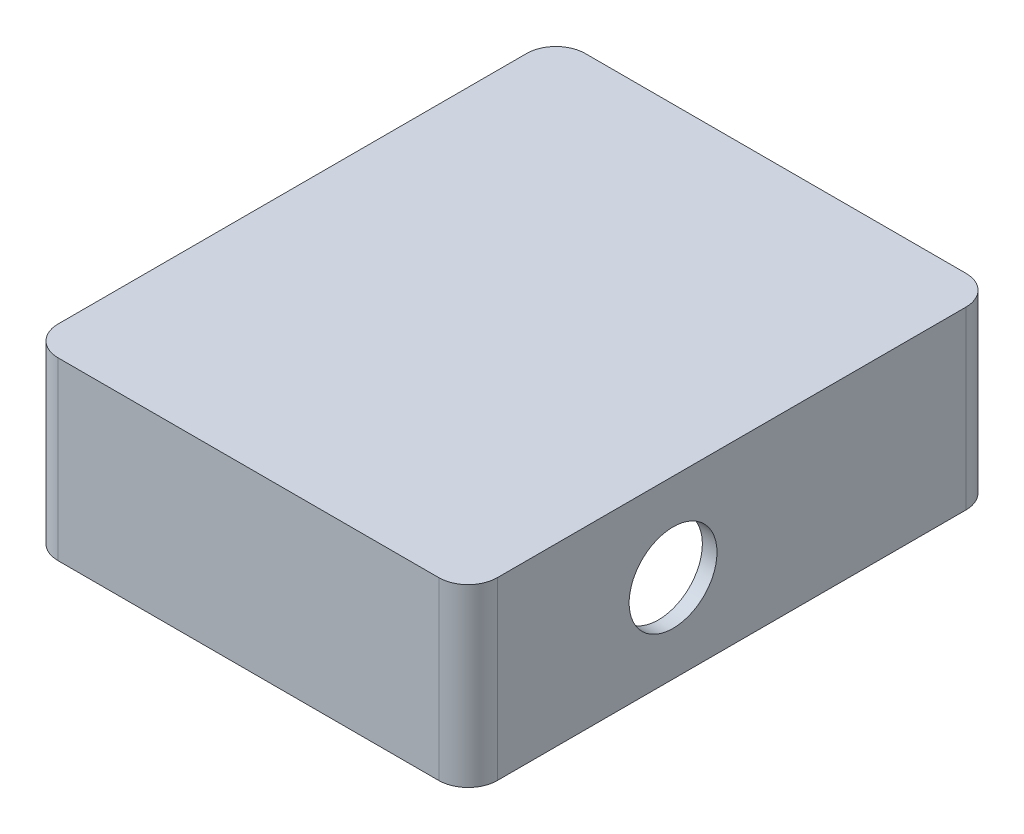
ISO-10303-21;
HEADER;
FILE_DESCRIPTION(('STEP AP214'),'2;1');
FILE_NAME('part.step','',(''),(''),'','','');
FILE_SCHEMA(('AUTOMOTIVE_DESIGN { 1 0 10303 214 1 1 1 1 }'));
ENDSEC;
DATA;
#1=APPLICATION_CONTEXT('core data for automotive mechanical design processes');
#2=APPLICATION_PROTOCOL_DEFINITION('international standard','automotive_design',2000,#1);
#3=PRODUCT_CONTEXT('',#1,'mechanical');
#4=PRODUCT('Part','Part','',(#3));
#5=PRODUCT_RELATED_PRODUCT_CATEGORY('part','',(#4));
#6=PRODUCT_DEFINITION_FORMATION('','',#4);
#7=PRODUCT_DEFINITION_CONTEXT('part definition',#1,'design');
#8=PRODUCT_DEFINITION('design','',#6,#7);
#9=PRODUCT_DEFINITION_SHAPE('','',#8);
#10=(LENGTH_UNIT() NAMED_UNIT(*) SI_UNIT(.MILLI.,.METRE.));
#11=(NAMED_UNIT(*) PLANE_ANGLE_UNIT() SI_UNIT($,.RADIAN.));
#12=(NAMED_UNIT(*) SI_UNIT($,.STERADIAN.) SOLID_ANGLE_UNIT());
#13=UNCERTAINTY_MEASURE_WITH_UNIT(LENGTH_MEASURE(1.E-05),#10,'distance_accuracy_value','');
#14=(GEOMETRIC_REPRESENTATION_CONTEXT(3) GLOBAL_UNCERTAINTY_ASSIGNED_CONTEXT((#13)) GLOBAL_UNIT_ASSIGNED_CONTEXT((#10,
#11,#12)) REPRESENTATION_CONTEXT('',''));
#15=CARTESIAN_POINT('',(0.,0.,0.));
#16=DIRECTION('',(0.,0.,1.));
#17=DIRECTION('',(1.,0.,0.));
#18=AXIS2_PLACEMENT_3D('',#15,#16,#17);
#19=CARTESIAN_POINT('',(5.,30.,-5.));
#20=DIRECTION('',(0.,-1.,0.));
#21=DIRECTION('',(0.,0.,-1.));
#22=AXIS2_PLACEMENT_3D('',#19,#20,#21);
#23=CYLINDRICAL_SURFACE('',#22,5.);
#24=CARTESIAN_POINT('',(5.,0.,-5.));
#25=DIRECTION('',(0.,-1.,0.));
#26=DIRECTION('',(0.,0.,-1.));
#27=AXIS2_PLACEMENT_3D('',#24,#25,#26);
#28=CIRCLE('',#27,5.);
#29=CARTESIAN_POINT('',(5.00000000000004,0.,0.));
#30=VERTEX_POINT('',#29);
#31=CARTESIAN_POINT('',(0.,0.,-5.00000000000003));
#32=VERTEX_POINT('',#31);
#33=EDGE_CURVE('E156',#30,#32,#28,.T.);
#34=ORIENTED_EDGE('',*,*,#33,.F.);
#35=DIRECTION('',(0.,-1.,0.));
#36=VECTOR('',#35,1.);
#37=CARTESIAN_POINT('',(5.00000000000004,30.,0.));
#38=LINE('',#37,#36);
#39=CARTESIAN_POINT('',(5.00000000000004,30.,0.));
#40=VERTEX_POINT('',#39);
#41=EDGE_CURVE('E11',#40,#30,#38,.T.);
#42=ORIENTED_EDGE('',*,*,#41,.F.);
#43=CARTESIAN_POINT('',(5.,30.,-5.));
#44=DIRECTION('',(0.,-1.,0.));
#45=DIRECTION('',(0.,0.,-1.));
#46=AXIS2_PLACEMENT_3D('',#43,#44,#45);
#47=CIRCLE('',#46,5.);
#48=CARTESIAN_POINT('',(0.,30.,-5.00000000000003));
#49=VERTEX_POINT('',#48);
#50=EDGE_CURVE('E184',#40,#49,#47,.T.);
#51=ORIENTED_EDGE('',*,*,#50,.T.);
#52=DIRECTION('',(0.,-1.,0.));
#53=VECTOR('',#52,1.);
#54=CARTESIAN_POINT('',(0.,30.,-5.00000000000003));
#55=LINE('',#54,#53);
#56=EDGE_CURVE('E100',#49,#32,#55,.T.);
#57=ORIENTED_EDGE('',*,*,#56,.T.);
#58=EDGE_LOOP('',(#34,#42,#51,#57));
#59=FACE_BOUND('',#58,.T.);
#60=ADVANCED_FACE('F38',(#59),#23,.T.);
#61=CARTESIAN_POINT('',(5.00000000000004,30.,0.));
#62=DIRECTION('',(0.,0.,-1.));
#63=DIRECTION('',(-1.,0.,0.));
#64=AXIS2_PLACEMENT_3D('',#61,#62,#63);
#65=PLANE('',#64);
#66=DIRECTION('',(1.,0.,0.));
#67=VECTOR('',#66,1.);
#68=CARTESIAN_POINT('',(5.00000000000004,0.,0.));
#69=LINE('',#68,#67);
#70=CARTESIAN_POINT('',(70.,0.,0.));
#71=VERTEX_POINT('',#70);
#72=EDGE_CURVE('E182',#30,#71,#69,.T.);
#73=ORIENTED_EDGE('',*,*,#72,.T.);
#74=DIRECTION('',(0.,-1.,0.));
#75=VECTOR('',#74,1.);
#76=CARTESIAN_POINT('',(70.,30.,0.));
#77=LINE('',#76,#75);
#78=CARTESIAN_POINT('',(70.,30.,0.));
#79=VERTEX_POINT('',#78);
#80=EDGE_CURVE('E47',#79,#71,#77,.T.);
#81=ORIENTED_EDGE('',*,*,#80,.F.);
#82=DIRECTION('',(1.,0.,0.));
#83=VECTOR('',#82,1.);
#84=CARTESIAN_POINT('',(5.00000000000004,30.,0.));
#85=LINE('',#84,#83);
#86=EDGE_CURVE('E127',#40,#79,#85,.T.);
#87=ORIENTED_EDGE('',*,*,#86,.F.);
#88=ORIENTED_EDGE('',*,*,#41,.T.);
#89=EDGE_LOOP('',(#73,#81,#87,#88));
#90=FACE_BOUND('',#89,.T.);
#91=ADVANCED_FACE('F203',(#90),#65,.F.);
#92=CARTESIAN_POINT('',(70.,30.,-5.));
#93=DIRECTION('',(0.,-1.,0.));
#94=DIRECTION('',(0.,0.,-1.));
#95=AXIS2_PLACEMENT_3D('',#92,#93,#94);
#96=CYLINDRICAL_SURFACE('',#95,5.);
#97=CARTESIAN_POINT('',(70.,0.,-5.));
#98=DIRECTION('',(0.,1.,0.));
#99=DIRECTION('',(0.,0.,1.));
#100=AXIS2_PLACEMENT_3D('',#97,#98,#99);
#101=CIRCLE('',#100,5.);
#102=CARTESIAN_POINT('',(75.,0.,-5.));
#103=VERTEX_POINT('',#102);
#104=EDGE_CURVE('E137',#71,#103,#101,.T.);
#105=ORIENTED_EDGE('',*,*,#104,.T.);
#106=DIRECTION('',(0.,-1.,0.));
#107=VECTOR('',#106,1.);
#108=CARTESIAN_POINT('',(75.,30.,-5.));
#109=LINE('',#108,#107);
#110=CARTESIAN_POINT('',(75.,30.,-5.));
#111=VERTEX_POINT('',#110);
#112=EDGE_CURVE('E134',#111,#103,#109,.T.);
#113=ORIENTED_EDGE('',*,*,#112,.F.);
#114=CARTESIAN_POINT('',(70.,30.,-5.));
#115=DIRECTION('',(0.,1.,0.));
#116=DIRECTION('',(0.,0.,1.));
#117=AXIS2_PLACEMENT_3D('',#114,#115,#116);
#118=CIRCLE('',#117,5.);
#119=EDGE_CURVE('E119',#79,#111,#118,.T.);
#120=ORIENTED_EDGE('',*,*,#119,.F.);
#121=ORIENTED_EDGE('',*,*,#80,.T.);
#122=EDGE_LOOP('',(#105,#113,#120,#121));
#123=FACE_BOUND('',#122,.T.);
#124=ADVANCED_FACE('F135',(#123),#96,.T.);
#125=CARTESIAN_POINT('',(75.,30.,-5.));
#126=DIRECTION('',(-1.,0.,0.));
#127=DIRECTION('',(0.,0.,1.));
#128=AXIS2_PLACEMENT_3D('',#125,#126,#127);
#129=PLANE('',#128);
#130=CARTESIAN_POINT('',(75.,15.,-35.));
#131=DIRECTION('',(1.,0.,0.));
#132=DIRECTION('',(0.,0.,-1.));
#133=AXIS2_PLACEMENT_3D('',#130,#131,#132);
#134=CIRCLE('',#133,7.50000000000001);
#135=CARTESIAN_POINT('',(75.,15.,-42.5));
#136=VERTEX_POINT('',#135);
#137=EDGE_CURVE('E296',#136,#136,#134,.T.);
#138=ORIENTED_EDGE('',*,*,#137,.F.);
#139=EDGE_LOOP('',(#138));
#140=FACE_BOUND('',#139,.T.);
#141=DIRECTION('',(0.,0.,-1.));
#142=VECTOR('',#141,1.);
#143=CARTESIAN_POINT('',(75.,0.,-5.));
#144=LINE('',#143,#142);
#145=CARTESIAN_POINT('',(75.,0.,-85.));
#146=VERTEX_POINT('',#145);
#147=EDGE_CURVE('E177',#103,#146,#144,.T.);
#148=ORIENTED_EDGE('',*,*,#147,.T.);
#149=DIRECTION('',(0.,-1.,0.));
#150=VECTOR('',#149,1.);
#151=CARTESIAN_POINT('',(75.,30.,-85.));
#152=LINE('',#151,#150);
#153=CARTESIAN_POINT('',(75.,30.,-85.));
#154=VERTEX_POINT('',#153);
#155=EDGE_CURVE('E142',#154,#146,#152,.T.);
#156=ORIENTED_EDGE('',*,*,#155,.F.);
#157=DIRECTION('',(0.,0.,-1.));
#158=VECTOR('',#157,1.);
#159=CARTESIAN_POINT('',(75.,30.,-5.));
#160=LINE('',#159,#158);
#161=EDGE_CURVE('E125',#111,#154,#160,.T.);
#162=ORIENTED_EDGE('',*,*,#161,.F.);
#163=ORIENTED_EDGE('',*,*,#112,.T.);
#164=EDGE_LOOP('',(#148,#156,#162,#163));
#165=FACE_BOUND('',#164,.T.);
#166=ADVANCED_FACE('F144',(#140,#165),#129,.F.);
#167=CARTESIAN_POINT('',(70.,30.,-85.));
#168=DIRECTION('',(0.,-1.,0.));
#169=DIRECTION('',(0.,0.,-1.));
#170=AXIS2_PLACEMENT_3D('',#167,#168,#169);
#171=CYLINDRICAL_SURFACE('',#170,5.);
#172=CARTESIAN_POINT('',(70.,0.,-85.));
#173=DIRECTION('',(0.,-1.,0.));
#174=DIRECTION('',(0.,0.,-1.));
#175=AXIS2_PLACEMENT_3D('',#172,#173,#174);
#176=CIRCLE('',#175,5.);
#177=CARTESIAN_POINT('',(70.,0.,-90.));
#178=VERTEX_POINT('',#177);
#179=EDGE_CURVE('E173',#178,#146,#176,.T.);
#180=ORIENTED_EDGE('',*,*,#179,.F.);
#181=DIRECTION('',(0.,-1.,0.));
#182=VECTOR('',#181,1.);
#183=CARTESIAN_POINT('',(70.,30.,-90.));
#184=LINE('',#183,#182);
#185=CARTESIAN_POINT('',(70.,30.,-90.));
#186=VERTEX_POINT('',#185);
#187=EDGE_CURVE('E190',#186,#178,#184,.T.);
#188=ORIENTED_EDGE('',*,*,#187,.F.);
#189=CARTESIAN_POINT('',(70.,30.,-85.));
#190=DIRECTION('',(0.,-1.,0.));
#191=DIRECTION('',(0.,0.,-1.));
#192=AXIS2_PLACEMENT_3D('',#189,#190,#191);
#193=CIRCLE('',#192,5.);
#194=EDGE_CURVE('E147',#186,#154,#193,.T.);
#195=ORIENTED_EDGE('',*,*,#194,.T.);
#196=ORIENTED_EDGE('',*,*,#155,.T.);
#197=EDGE_LOOP('',(#180,#188,#195,#196));
#198=FACE_BOUND('',#197,.T.);
#199=ADVANCED_FACE('F227',(#198),#171,.T.);
#200=CARTESIAN_POINT('',(5.00000000000004,30.,-90.));
#201=DIRECTION('',(0.,0.,-1.));
#202=DIRECTION('',(-1.,0.,0.));
#203=AXIS2_PLACEMENT_3D('',#200,#201,#202);
#204=PLANE('',#203);
#205=DIRECTION('',(1.,0.,0.));
#206=VECTOR('',#205,1.);
#207=CARTESIAN_POINT('',(5.00000000000004,0.,-90.));
#208=LINE('',#207,#206);
#209=CARTESIAN_POINT('',(5.,0.,-90.));
#210=VERTEX_POINT('',#209);
#211=EDGE_CURVE('E169',#210,#178,#208,.T.);
#212=ORIENTED_EDGE('',*,*,#211,.F.);
#213=DIRECTION('',(0.,-1.,0.));
#214=VECTOR('',#213,1.);
#215=CARTESIAN_POINT('',(5.,30.,-90.));
#216=LINE('',#215,#214);
#217=CARTESIAN_POINT('',(5.,30.,-90.));
#218=VERTEX_POINT('',#217);
#219=EDGE_CURVE('E193',#218,#210,#216,.T.);
#220=ORIENTED_EDGE('',*,*,#219,.F.);
#221=DIRECTION('',(1.,0.,0.));
#222=VECTOR('',#221,1.);
#223=CARTESIAN_POINT('',(5.00000000000004,30.,-90.));
#224=LINE('',#223,#222);
#225=EDGE_CURVE('E150',#218,#186,#224,.T.);
#226=ORIENTED_EDGE('',*,*,#225,.T.);
#227=ORIENTED_EDGE('',*,*,#187,.T.);
#228=EDGE_LOOP('',(#212,#220,#226,#227));
#229=FACE_BOUND('',#228,.T.);
#230=ADVANCED_FACE('F222',(#229),#204,.T.);
#231=CARTESIAN_POINT('',(5.,30.,-85.));
#232=DIRECTION('',(0.,-1.,0.));
#233=DIRECTION('',(0.,0.,-1.));
#234=AXIS2_PLACEMENT_3D('',#231,#232,#233);
#235=CYLINDRICAL_SURFACE('',#234,5.);
#236=CARTESIAN_POINT('',(5.,0.,-85.));
#237=DIRECTION('',(0.,-1.,0.));
#238=DIRECTION('',(0.,0.,-1.));
#239=AXIS2_PLACEMENT_3D('',#236,#237,#238);
#240=CIRCLE('',#239,5.);
#241=CARTESIAN_POINT('',(0.,0.,-85.));
#242=VERTEX_POINT('',#241);
#243=EDGE_CURVE('E165',#242,#210,#240,.T.);
#244=ORIENTED_EDGE('',*,*,#243,.F.);
#245=DIRECTION('',(0.,-1.,0.));
#246=VECTOR('',#245,1.);
#247=CARTESIAN_POINT('',(0.,30.,-85.));
#248=LINE('',#247,#246);
#249=CARTESIAN_POINT('',(0.,30.,-85.));
#250=VERTEX_POINT('',#249);
#251=EDGE_CURVE('E196',#250,#242,#248,.T.);
#252=ORIENTED_EDGE('',*,*,#251,.F.);
#253=CARTESIAN_POINT('',(5.,30.,-85.));
#254=DIRECTION('',(0.,-1.,0.));
#255=DIRECTION('',(0.,0.,-1.));
#256=AXIS2_PLACEMENT_3D('',#253,#254,#255);
#257=CIRCLE('',#256,5.);
#258=EDGE_CURVE('E209',#250,#218,#257,.T.);
#259=ORIENTED_EDGE('',*,*,#258,.T.);
#260=ORIENTED_EDGE('',*,*,#219,.T.);
#261=EDGE_LOOP('',(#244,#252,#259,#260));
#262=FACE_BOUND('',#261,.T.);
#263=ADVANCED_FACE('F225',(#262),#235,.T.);
#264=CARTESIAN_POINT('',(0.,30.,-5.00000000000003));
#265=DIRECTION('',(-1.,0.,0.));
#266=DIRECTION('',(0.,0.,1.));
#267=AXIS2_PLACEMENT_3D('',#264,#265,#266);
#268=PLANE('',#267);
#269=DIRECTION('',(0.,0.,-1.));
#270=VECTOR('',#269,1.);
#271=CARTESIAN_POINT('',(0.,0.,-5.00000000000003));
#272=LINE('',#271,#270);
#273=EDGE_CURVE('E160',#32,#242,#272,.T.);
#274=ORIENTED_EDGE('',*,*,#273,.F.);
#275=ORIENTED_EDGE('',*,*,#56,.F.);
#276=DIRECTION('',(0.,0.,-1.));
#277=VECTOR('',#276,1.);
#278=CARTESIAN_POINT('',(0.,30.,-5.00000000000003));
#279=LINE('',#278,#277);
#280=EDGE_CURVE('E205',#49,#250,#279,.T.);
#281=ORIENTED_EDGE('',*,*,#280,.T.);
#282=ORIENTED_EDGE('',*,*,#251,.T.);
#283=EDGE_LOOP('',(#274,#275,#281,#282));
#284=FACE_BOUND('',#283,.T.);
#285=ADVANCED_FACE('F199',(#284),#268,.T.);
#286=CARTESIAN_POINT('',(5.,30.,-5.));
#287=DIRECTION('',(0.,-1.,0.));
#288=DIRECTION('',(0.,0.,-1.));
#289=AXIS2_PLACEMENT_3D('',#286,#287,#288);
#290=PLANE('',#289);
#291=ORIENTED_EDGE('',*,*,#50,.F.);
#292=ORIENTED_EDGE('',*,*,#86,.T.);
#293=ORIENTED_EDGE('',*,*,#119,.T.);
#294=ORIENTED_EDGE('',*,*,#161,.T.);
#295=ORIENTED_EDGE('',*,*,#194,.F.);
#296=ORIENTED_EDGE('',*,*,#225,.F.);
#297=ORIENTED_EDGE('',*,*,#258,.F.);
#298=ORIENTED_EDGE('',*,*,#280,.F.);
#299=EDGE_LOOP('',(#291,#292,#293,#294,#295,#296,#297,#298));
#300=FACE_BOUND('',#299,.T.);
#301=ADVANCED_FACE('F122',(#300),#290,.F.);
#302=CARTESIAN_POINT('',(5.,0.,-5.));
#303=DIRECTION('',(0.,-1.,0.));
#304=DIRECTION('',(0.,0.,-1.));
#305=AXIS2_PLACEMENT_3D('',#302,#303,#304);
#306=PLANE('',#305);
#307=CARTESIAN_POINT('',(7.5,0.,-7.5));
#308=DIRECTION('',(0.,-1.,0.));
#309=DIRECTION('',(0.,0.,1.));
#310=AXIS2_PLACEMENT_3D('',#307,#308,#309);
#311=CIRCLE('',#310,5.);
#312=CARTESIAN_POINT('',(7.50000000000003,0.,-2.5));
#313=VERTEX_POINT('',#312);
#314=CARTESIAN_POINT('',(2.5,0.,-7.50000000000003));
#315=VERTEX_POINT('',#314);
#316=EDGE_CURVE('E55',#313,#315,#311,.T.);
#317=ORIENTED_EDGE('',*,*,#316,.F.);
#318=DIRECTION('',(-1.,0.,0.));
#319=VECTOR('',#318,1.);
#320=CARTESIAN_POINT('',(7.50000000000003,0.,-2.5));
#321=LINE('',#320,#319);
#322=CARTESIAN_POINT('',(67.5,0.,-2.49999999999999));
#323=VERTEX_POINT('',#322);
#324=EDGE_CURVE('E311',#323,#313,#321,.T.);
#325=ORIENTED_EDGE('',*,*,#324,.F.);
#326=CARTESIAN_POINT('',(67.5,0.,-7.49999999999999));
#327=DIRECTION('',(0.,-1.,0.));
#328=DIRECTION('',(0.,0.,1.));
#329=AXIS2_PLACEMENT_3D('',#326,#327,#328);
#330=CIRCLE('',#329,5.);
#331=CARTESIAN_POINT('',(72.5,0.,-7.49999999999999));
#332=VERTEX_POINT('',#331);
#333=EDGE_CURVE('E358',#332,#323,#330,.T.);
#334=ORIENTED_EDGE('',*,*,#333,.F.);
#335=DIRECTION('',(0.,0.,1.));
#336=VECTOR('',#335,1.);
#337=CARTESIAN_POINT('',(72.5,0.,-7.49999999999999));
#338=LINE('',#337,#336);
#339=CARTESIAN_POINT('',(72.5,0.,-82.5));
#340=VERTEX_POINT('',#339);
#341=EDGE_CURVE('E354',#340,#332,#338,.T.);
#342=ORIENTED_EDGE('',*,*,#341,.F.);
#343=CARTESIAN_POINT('',(67.5,0.,-82.5));
#344=DIRECTION('',(0.,-1.,0.));
#345=DIRECTION('',(0.,0.,-1.));
#346=AXIS2_PLACEMENT_3D('',#343,#344,#345);
#347=CIRCLE('',#346,5.);
#348=CARTESIAN_POINT('',(67.5,0.,-87.5));
#349=VERTEX_POINT('',#348);
#350=EDGE_CURVE('E350',#349,#340,#347,.T.);
#351=ORIENTED_EDGE('',*,*,#350,.F.);
#352=DIRECTION('',(1.,0.,0.));
#353=VECTOR('',#352,1.);
#354=CARTESIAN_POINT('',(7.50000000000004,0.,-87.5));
#355=LINE('',#354,#353);
#356=CARTESIAN_POINT('',(7.5,0.,-87.5));
#357=VERTEX_POINT('',#356);
#358=EDGE_CURVE('E346',#357,#349,#355,.T.);
#359=ORIENTED_EDGE('',*,*,#358,.F.);
#360=CARTESIAN_POINT('',(7.5,0.,-82.5));
#361=DIRECTION('',(0.,-1.,0.));
#362=DIRECTION('',(0.,0.,-1.));
#363=AXIS2_PLACEMENT_3D('',#360,#361,#362);
#364=CIRCLE('',#363,5.);
#365=CARTESIAN_POINT('',(2.5,0.,-82.5));
#366=VERTEX_POINT('',#365);
#367=EDGE_CURVE('E342',#366,#357,#364,.T.);
#368=ORIENTED_EDGE('',*,*,#367,.F.);
#369=DIRECTION('',(0.,0.,-1.));
#370=VECTOR('',#369,1.);
#371=CARTESIAN_POINT('',(2.5,0.,-7.50000000000003));
#372=LINE('',#371,#370);
#373=EDGE_CURVE('E302',#315,#366,#372,.T.);
#374=ORIENTED_EDGE('',*,*,#373,.F.);
#375=EDGE_LOOP('',(#317,#325,#334,#342,#351,#359,#368,#374));
#376=FACE_BOUND('',#375,.T.);
#377=ORIENTED_EDGE('',*,*,#33,.T.);
#378=ORIENTED_EDGE('',*,*,#273,.T.);
#379=ORIENTED_EDGE('',*,*,#243,.T.);
#380=ORIENTED_EDGE('',*,*,#211,.T.);
#381=ORIENTED_EDGE('',*,*,#179,.T.);
#382=ORIENTED_EDGE('',*,*,#147,.F.);
#383=ORIENTED_EDGE('',*,*,#104,.F.);
#384=ORIENTED_EDGE('',*,*,#72,.F.);
#385=EDGE_LOOP('',(#377,#378,#379,#380,#381,#382,#383,#384));
#386=FACE_BOUND('',#385,.T.);
#387=ADVANCED_FACE('F202',(#376,#386),#306,.T.);
#388=CARTESIAN_POINT('',(7.5,28.,-7.5));
#389=DIRECTION('',(0.,-1.,0.));
#390=DIRECTION('',(0.,0.,-1.));
#391=AXIS2_PLACEMENT_3D('',#388,#389,#390);
#392=CYLINDRICAL_SURFACE('',#391,5.);
#393=ORIENTED_EDGE('',*,*,#316,.T.);
#394=DIRECTION('',(0.,-1.,0.));
#395=VECTOR('',#394,1.);
#396=CARTESIAN_POINT('',(2.5,28.,-7.50000000000003));
#397=LINE('',#396,#395);
#398=CARTESIAN_POINT('',(2.5,28.,-7.50000000000003));
#399=VERTEX_POINT('',#398);
#400=EDGE_CURVE('E212',#399,#315,#397,.T.);
#401=ORIENTED_EDGE('',*,*,#400,.F.);
#402=CARTESIAN_POINT('',(7.5,28.,-7.5));
#403=DIRECTION('',(0.,-1.,0.));
#404=DIRECTION('',(0.,0.,1.));
#405=AXIS2_PLACEMENT_3D('',#402,#403,#404);
#406=CIRCLE('',#405,5.);
#407=CARTESIAN_POINT('',(7.50000000000003,28.,-2.5));
#408=VERTEX_POINT('',#407);
#409=EDGE_CURVE('E306',#408,#399,#406,.T.);
#410=ORIENTED_EDGE('',*,*,#409,.F.);
#411=DIRECTION('',(0.,-1.,0.));
#412=VECTOR('',#411,1.);
#413=CARTESIAN_POINT('',(7.50000000000003,28.,-2.5));
#414=LINE('',#413,#412);
#415=EDGE_CURVE('E161',#408,#313,#414,.T.);
#416=ORIENTED_EDGE('',*,*,#415,.T.);
#417=EDGE_LOOP('',(#393,#401,#410,#416));
#418=FACE_BOUND('',#417,.T.);
#419=ADVANCED_FACE('F250',(#418),#392,.F.);
#420=CARTESIAN_POINT('',(7.50000000000003,28.,-2.5));
#421=DIRECTION('',(0.,0.,1.));
#422=DIRECTION('',(1.,0.,0.));
#423=AXIS2_PLACEMENT_3D('',#420,#421,#422);
#424=PLANE('',#423);
#425=ORIENTED_EDGE('',*,*,#324,.T.);
#426=ORIENTED_EDGE('',*,*,#415,.F.);
#427=DIRECTION('',(-1.,0.,0.));
#428=VECTOR('',#427,1.);
#429=CARTESIAN_POINT('',(7.50000000000003,28.,-2.5));
#430=LINE('',#429,#428);
#431=CARTESIAN_POINT('',(67.5,28.,-2.49999999999999));
#432=VERTEX_POINT('',#431);
#433=EDGE_CURVE('E335',#432,#408,#430,.T.);
#434=ORIENTED_EDGE('',*,*,#433,.F.);
#435=DIRECTION('',(0.,-1.,0.));
#436=VECTOR('',#435,1.);
#437=CARTESIAN_POINT('',(67.5,28.,-2.49999999999999));
#438=LINE('',#437,#436);
#439=EDGE_CURVE('E367',#432,#323,#438,.T.);
#440=ORIENTED_EDGE('',*,*,#439,.T.);
#441=EDGE_LOOP('',(#425,#426,#434,#440));
#442=FACE_BOUND('',#441,.T.);
#443=ADVANCED_FACE('F256',(#442),#424,.F.);
#444=CARTESIAN_POINT('',(67.5,28.,-7.49999999999999));
#445=DIRECTION('',(0.,-1.,0.));
#446=DIRECTION('',(0.,0.,-1.));
#447=AXIS2_PLACEMENT_3D('',#444,#445,#446);
#448=CYLINDRICAL_SURFACE('',#447,5.);
#449=ORIENTED_EDGE('',*,*,#333,.T.);
#450=ORIENTED_EDGE('',*,*,#439,.F.);
#451=CARTESIAN_POINT('',(67.5,28.,-7.49999999999999));
#452=DIRECTION('',(0.,-1.,0.));
#453=DIRECTION('',(0.,0.,1.));
#454=AXIS2_PLACEMENT_3D('',#451,#452,#453);
#455=CIRCLE('',#454,5.);
#456=CARTESIAN_POINT('',(72.5,28.,-7.49999999999999));
#457=VERTEX_POINT('',#456);
#458=EDGE_CURVE('E331',#457,#432,#455,.T.);
#459=ORIENTED_EDGE('',*,*,#458,.F.);
#460=DIRECTION('',(0.,-1.,0.));
#461=VECTOR('',#460,1.);
#462=CARTESIAN_POINT('',(72.5,28.,-7.49999999999999));
#463=LINE('',#462,#461);
#464=EDGE_CURVE('E371',#457,#332,#463,.T.);
#465=ORIENTED_EDGE('',*,*,#464,.T.);
#466=EDGE_LOOP('',(#449,#450,#459,#465));
#467=FACE_BOUND('',#466,.T.);
#468=ADVANCED_FACE('F277',(#467),#448,.F.);
#469=CARTESIAN_POINT('',(72.5,28.,-7.49999999999999));
#470=DIRECTION('',(1.,0.,0.));
#471=DIRECTION('',(0.,0.,-1.));
#472=AXIS2_PLACEMENT_3D('',#469,#470,#471);
#473=PLANE('',#472);
#474=CARTESIAN_POINT('',(72.5,15.,-35.));
#475=DIRECTION('',(1.,0.,0.));
#476=DIRECTION('',(0.,0.,-1.));
#477=AXIS2_PLACEMENT_3D('',#474,#475,#476);
#478=CIRCLE('',#477,7.50000000000001);
#479=CARTESIAN_POINT('',(72.5,15.,-42.5));
#480=VERTEX_POINT('',#479);
#481=EDGE_CURVE('E41',#480,#480,#478,.T.);
#482=ORIENTED_EDGE('',*,*,#481,.T.);
#483=EDGE_LOOP('',(#482));
#484=FACE_BOUND('',#483,.T.);
#485=ORIENTED_EDGE('',*,*,#341,.T.);
#486=ORIENTED_EDGE('',*,*,#464,.F.);
#487=DIRECTION('',(0.,0.,1.));
#488=VECTOR('',#487,1.);
#489=CARTESIAN_POINT('',(72.5,28.,-7.49999999999999));
#490=LINE('',#489,#488);
#491=CARTESIAN_POINT('',(72.5,28.,-82.5));
#492=VERTEX_POINT('',#491);
#493=EDGE_CURVE('E327',#492,#457,#490,.T.);
#494=ORIENTED_EDGE('',*,*,#493,.F.);
#495=DIRECTION('',(0.,-1.,0.));
#496=VECTOR('',#495,1.);
#497=CARTESIAN_POINT('',(72.5,28.,-82.5));
#498=LINE('',#497,#496);
#499=EDGE_CURVE('E375',#492,#340,#498,.T.);
#500=ORIENTED_EDGE('',*,*,#499,.T.);
#501=EDGE_LOOP('',(#485,#486,#494,#500));
#502=FACE_BOUND('',#501,.T.);
#503=ADVANCED_FACE('F273',(#484,#502),#473,.F.);
#504=CARTESIAN_POINT('',(67.5,28.,-82.5));
#505=DIRECTION('',(0.,-1.,0.));
#506=DIRECTION('',(0.,0.,-1.));
#507=AXIS2_PLACEMENT_3D('',#504,#505,#506);
#508=CYLINDRICAL_SURFACE('',#507,5.);
#509=ORIENTED_EDGE('',*,*,#350,.T.);
#510=ORIENTED_EDGE('',*,*,#499,.F.);
#511=CARTESIAN_POINT('',(67.5,28.,-82.5));
#512=DIRECTION('',(0.,-1.,0.));
#513=DIRECTION('',(0.,0.,-1.));
#514=AXIS2_PLACEMENT_3D('',#511,#512,#513);
#515=CIRCLE('',#514,5.);
#516=CARTESIAN_POINT('',(67.5,28.,-87.5));
#517=VERTEX_POINT('',#516);
#518=EDGE_CURVE('E323',#517,#492,#515,.T.);
#519=ORIENTED_EDGE('',*,*,#518,.F.);
#520=DIRECTION('',(0.,-1.,0.));
#521=VECTOR('',#520,1.);
#522=CARTESIAN_POINT('',(67.5,28.,-87.5));
#523=LINE('',#522,#521);
#524=EDGE_CURVE('E379',#517,#349,#523,.T.);
#525=ORIENTED_EDGE('',*,*,#524,.T.);
#526=EDGE_LOOP('',(#509,#510,#519,#525));
#527=FACE_BOUND('',#526,.T.);
#528=ADVANCED_FACE('F269',(#527),#508,.F.);
#529=CARTESIAN_POINT('',(7.50000000000004,28.,-87.5));
#530=DIRECTION('',(0.,0.,-1.));
#531=DIRECTION('',(-1.,0.,0.));
#532=AXIS2_PLACEMENT_3D('',#529,#530,#531);
#533=PLANE('',#532);
#534=ORIENTED_EDGE('',*,*,#358,.T.);
#535=ORIENTED_EDGE('',*,*,#524,.F.);
#536=DIRECTION('',(1.,0.,0.));
#537=VECTOR('',#536,1.);
#538=CARTESIAN_POINT('',(7.50000000000004,28.,-87.5));
#539=LINE('',#538,#537);
#540=CARTESIAN_POINT('',(7.5,28.,-87.5));
#541=VERTEX_POINT('',#540);
#542=EDGE_CURVE('E319',#541,#517,#539,.T.);
#543=ORIENTED_EDGE('',*,*,#542,.F.);
#544=DIRECTION('',(0.,-1.,0.));
#545=VECTOR('',#544,1.);
#546=CARTESIAN_POINT('',(7.5,28.,-87.5));
#547=LINE('',#546,#545);
#548=EDGE_CURVE('E383',#541,#357,#547,.T.);
#549=ORIENTED_EDGE('',*,*,#548,.T.);
#550=EDGE_LOOP('',(#534,#535,#543,#549));
#551=FACE_BOUND('',#550,.T.);
#552=ADVANCED_FACE('F265',(#551),#533,.F.);
#553=CARTESIAN_POINT('',(7.5,28.,-82.5));
#554=DIRECTION('',(0.,-1.,0.));
#555=DIRECTION('',(0.,0.,-1.));
#556=AXIS2_PLACEMENT_3D('',#553,#554,#555);
#557=CYLINDRICAL_SURFACE('',#556,5.);
#558=ORIENTED_EDGE('',*,*,#367,.T.);
#559=ORIENTED_EDGE('',*,*,#548,.F.);
#560=CARTESIAN_POINT('',(7.5,28.,-82.5));
#561=DIRECTION('',(0.,-1.,0.));
#562=DIRECTION('',(0.,0.,-1.));
#563=AXIS2_PLACEMENT_3D('',#560,#561,#562);
#564=CIRCLE('',#563,5.);
#565=CARTESIAN_POINT('',(2.5,28.,-82.5));
#566=VERTEX_POINT('',#565);
#567=EDGE_CURVE('E315',#566,#541,#564,.T.);
#568=ORIENTED_EDGE('',*,*,#567,.F.);
#569=DIRECTION('',(0.,-1.,0.));
#570=VECTOR('',#569,1.);
#571=CARTESIAN_POINT('',(2.5,28.,-82.5));
#572=LINE('',#571,#570);
#573=EDGE_CURVE('E386',#566,#366,#572,.T.);
#574=ORIENTED_EDGE('',*,*,#573,.T.);
#575=EDGE_LOOP('',(#558,#559,#568,#574));
#576=FACE_BOUND('',#575,.T.);
#577=ADVANCED_FACE('F261',(#576),#557,.F.);
#578=CARTESIAN_POINT('',(2.5,28.,-7.50000000000003));
#579=DIRECTION('',(-1.,0.,0.));
#580=DIRECTION('',(0.,0.,1.));
#581=AXIS2_PLACEMENT_3D('',#578,#579,#580);
#582=PLANE('',#581);
#583=ORIENTED_EDGE('',*,*,#373,.T.);
#584=ORIENTED_EDGE('',*,*,#573,.F.);
#585=DIRECTION('',(0.,0.,-1.));
#586=VECTOR('',#585,1.);
#587=CARTESIAN_POINT('',(2.5,28.,-7.50000000000003));
#588=LINE('',#587,#586);
#589=EDGE_CURVE('E310',#399,#566,#588,.T.);
#590=ORIENTED_EDGE('',*,*,#589,.F.);
#591=ORIENTED_EDGE('',*,*,#400,.T.);
#592=EDGE_LOOP('',(#583,#584,#590,#591));
#593=FACE_BOUND('',#592,.T.);
#594=ADVANCED_FACE('F257',(#593),#582,.F.);
#595=CARTESIAN_POINT('',(7.5,28.,-7.5));
#596=DIRECTION('',(0.,1.,0.));
#597=DIRECTION('',(0.,0.,1.));
#598=AXIS2_PLACEMENT_3D('',#595,#596,#597);
#599=PLANE('',#598);
#600=ORIENTED_EDGE('',*,*,#409,.T.);
#601=ORIENTED_EDGE('',*,*,#589,.T.);
#602=ORIENTED_EDGE('',*,*,#567,.T.);
#603=ORIENTED_EDGE('',*,*,#542,.T.);
#604=ORIENTED_EDGE('',*,*,#518,.T.);
#605=ORIENTED_EDGE('',*,*,#493,.T.);
#606=ORIENTED_EDGE('',*,*,#458,.T.);
#607=ORIENTED_EDGE('',*,*,#433,.T.);
#608=EDGE_LOOP('',(#600,#601,#602,#603,#604,#605,#606,#607));
#609=FACE_BOUND('',#608,.T.);
#610=ADVANCED_FACE('F260',(#609),#599,.F.);
#611=CARTESIAN_POINT('',(71.,15.,-35.));
#612=DIRECTION('',(1.,0.,0.));
#613=DIRECTION('',(0.,0.,-1.));
#614=AXIS2_PLACEMENT_3D('',#611,#612,#613);
#615=CYLINDRICAL_SURFACE('',#614,7.50000000000001);
#616=ORIENTED_EDGE('',*,*,#137,.T.);
#617=EDGE_LOOP('',(#616));
#618=FACE_BOUND('',#617,.T.);
#619=ORIENTED_EDGE('',*,*,#481,.F.);
#620=EDGE_LOOP('',(#619));
#621=FACE_BOUND('',#620,.T.);
#622=ADVANCED_FACE('F287',(#618,#621),#615,.F.);
#623=CLOSED_SHELL('',(#60,#91,#124,#166,#199,#230,#263,#285,#301,#387,#419,#443,#468,#503,#528,
#552,#577,#594,#610,#622));
#624=MANIFOLD_SOLID_BREP('B2',#623);
#625=ADVANCED_BREP_SHAPE_REPRESENTATION('',(#18,#624),#14);
#626=SHAPE_DEFINITION_REPRESENTATION(#9,#625);
ENDSEC;
END-ISO-10303-21;
